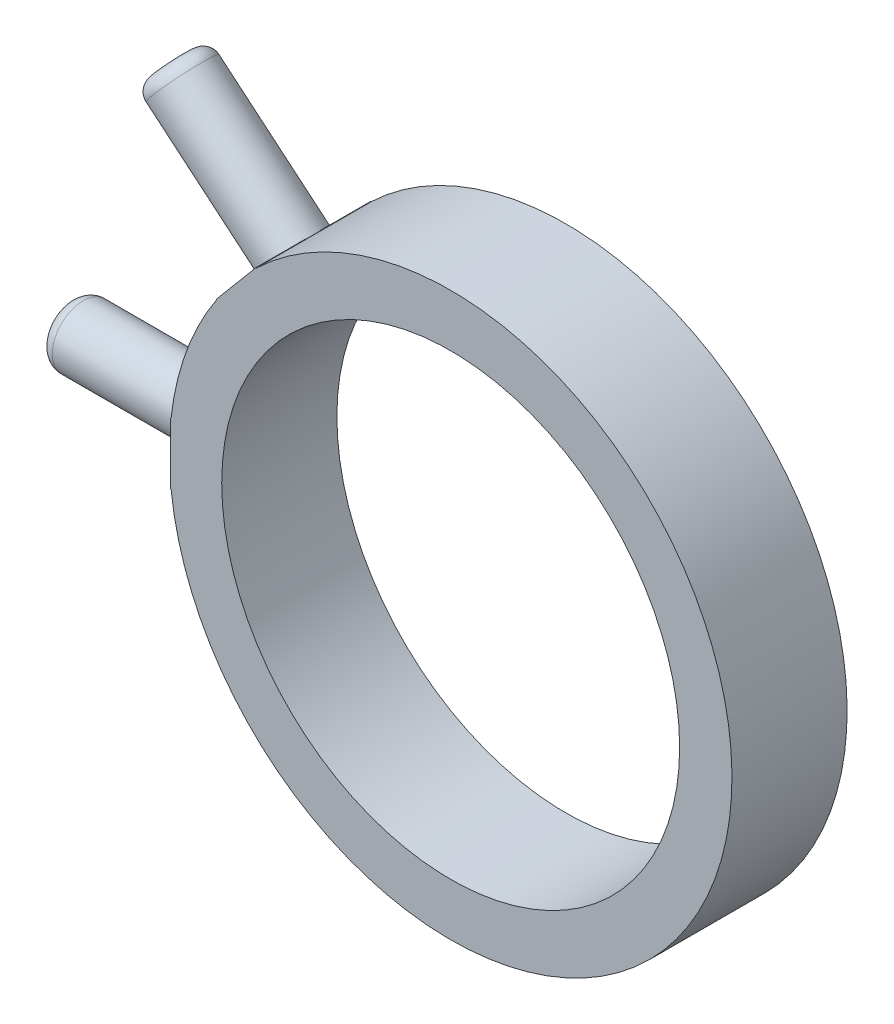
ISO-10303-21;
HEADER;
FILE_DESCRIPTION(('STEP AP214'),'2;1');
FILE_NAME('part.step','',(''),(''),'','','');
FILE_SCHEMA(('AUTOMOTIVE_DESIGN { 1 0 10303 214 1 1 1 1 }'));
ENDSEC;
DATA;
#1=APPLICATION_CONTEXT('core data for automotive mechanical design processes');
#2=APPLICATION_PROTOCOL_DEFINITION('international standard','automotive_design',2000,#1);
#3=PRODUCT_CONTEXT('',#1,'mechanical');
#4=PRODUCT('Part','Part','',(#3));
#5=PRODUCT_RELATED_PRODUCT_CATEGORY('part','',(#4));
#6=PRODUCT_DEFINITION_FORMATION('','',#4);
#7=PRODUCT_DEFINITION_CONTEXT('part definition',#1,'design');
#8=PRODUCT_DEFINITION('design','',#6,#7);
#9=PRODUCT_DEFINITION_SHAPE('','',#8);
#10=(LENGTH_UNIT() NAMED_UNIT(*) SI_UNIT(.MILLI.,.METRE.));
#11=(NAMED_UNIT(*) PLANE_ANGLE_UNIT() SI_UNIT($,.RADIAN.));
#12=(NAMED_UNIT(*) SI_UNIT($,.STERADIAN.) SOLID_ANGLE_UNIT());
#13=UNCERTAINTY_MEASURE_WITH_UNIT(LENGTH_MEASURE(1.E-05),#10,'distance_accuracy_value','');
#14=(GEOMETRIC_REPRESENTATION_CONTEXT(3) GLOBAL_UNCERTAINTY_ASSIGNED_CONTEXT((#13)) GLOBAL_UNIT_ASSIGNED_CONTEXT((#10,
#11,#12)) REPRESENTATION_CONTEXT('',''));
#15=CARTESIAN_POINT('',(0.,0.,0.));
#16=DIRECTION('',(0.,0.,1.));
#17=DIRECTION('',(1.,0.,0.));
#18=AXIS2_PLACEMENT_3D('',#15,#16,#17);
#19=CARTESIAN_POINT('',(0.,0.,8.8));
#20=DIRECTION('',(0.,0.,1.));
#21=DIRECTION('',(1.,0.,0.));
#22=AXIS2_PLACEMENT_3D('',#19,#20,#21);
#23=PLANE('',#22);
#24=CARTESIAN_POINT('',(0.,0.,8.8));
#25=DIRECTION('',(0.,0.,1.));
#26=DIRECTION('',(1.,0.,0.));
#27=AXIS2_PLACEMENT_3D('',#24,#25,#26);
#28=CIRCLE('',#27,17.5);
#29=CARTESIAN_POINT('',(17.5,0.,8.8));
#30=VERTEX_POINT('',#29);
#31=EDGE_CURVE('E193',#30,#30,#28,.T.);
#32=ORIENTED_EDGE('',*,*,#31,.F.);
#33=EDGE_LOOP('',(#32));
#34=FACE_BOUND('',#33,.T.);
#35=DIRECTION('',(1.,0.,0.));
#36=VECTOR('',#35,1.);
#37=CARTESIAN_POINT('',(-21.5,2.35,8.8));
#38=LINE('',#37,#36);
#39=CARTESIAN_POINT('',(-21.4,2.35,8.8));
#40=VERTEX_POINT('',#39);
#41=CARTESIAN_POINT('',(-21.3711838698749,2.35,8.8));
#42=VERTEX_POINT('',#41);
#43=EDGE_CURVE('E213',#40,#42,#38,.T.);
#44=ORIENTED_EDGE('',*,*,#43,.F.);
#45=DIRECTION('',(0.,-1.,0.));
#46=VECTOR('',#45,1.);
#47=CARTESIAN_POINT('',(-21.4,0.,8.8));
#48=LINE('',#47,#46);
#49=CARTESIAN_POINT('',(-21.4,-2.35,8.8));
#50=VERTEX_POINT('',#49);
#51=EDGE_CURVE('E160',#40,#50,#48,.T.);
#52=ORIENTED_EDGE('',*,*,#51,.T.);
#53=DIRECTION('',(1.,0.,0.));
#54=VECTOR('',#53,1.);
#55=CARTESIAN_POINT('',(-21.5,-2.35,8.8));
#56=LINE('',#55,#54);
#57=CARTESIAN_POINT('',(-21.3711838698749,-2.35,8.8));
#58=VERTEX_POINT('',#57);
#59=EDGE_CURVE('E200',#50,#58,#56,.T.);
#60=ORIENTED_EDGE('',*,*,#59,.T.);
#61=CARTESIAN_POINT('',(0.,0.,8.8));
#62=DIRECTION('',(0.,0.,1.));
#63=DIRECTION('',(1.,0.,0.));
#64=AXIS2_PLACEMENT_3D('',#61,#62,#63);
#65=CIRCLE('',#64,21.5);
#66=CARTESIAN_POINT('',(-14.8607257636283,15.537336637218,8.8));
#67=VERTEX_POINT('',#66);
#68=EDGE_CURVE('E202',#58,#67,#65,.T.);
#69=ORIENTED_EDGE('',*,*,#68,.T.);
#70=DIRECTION('',(0.766044443118975,-0.642787609686543,0.));
#71=VECTOR('',#70,1.);
#72=CARTESIAN_POINT('',(-24.151937961723,23.3335893658292,8.8));
#73=LINE('',#72,#71);
#74=CARTESIAN_POINT('',(-14.8828001999834,15.555859288622,8.8));
#75=VERTEX_POINT('',#74);
#76=EDGE_CURVE('E206',#75,#67,#73,.T.);
#77=ORIENTED_EDGE('',*,*,#76,.F.);
#78=DIRECTION('',(-0.642787609686543,-0.766044443118975,0.));
#79=VECTOR('',#78,1.);
#80=CARTESIAN_POINT('',(-16.3933510827467,13.7556548472926,8.8));
#81=LINE('',#80,#79);
#82=CARTESIAN_POINT('',(-17.9039019655102,11.9554504059628,8.8));
#83=VERTEX_POINT('',#82);
#84=EDGE_CURVE('E186',#75,#83,#81,.T.);
#85=ORIENTED_EDGE('',*,*,#84,.T.);
#86=DIRECTION('',(0.766044443118975,-0.642787609686543,0.));
#87=VECTOR('',#86,1.);
#88=CARTESIAN_POINT('',(-27.1730397272498,19.73318048317,8.8));
#89=LINE('',#88,#87);
#90=CARTESIAN_POINT('',(-17.881827529155,11.9369277545587,8.8));
#91=VERTEX_POINT('',#90);
#92=EDGE_CURVE('E208',#83,#91,#89,.T.);
#93=ORIENTED_EDGE('',*,*,#92,.T.);
#94=CARTESIAN_POINT('',(0.,0.,8.8));
#95=DIRECTION('',(0.,0.,1.));
#96=DIRECTION('',(1.,0.,0.));
#97=AXIS2_PLACEMENT_3D('',#94,#95,#96);
#98=CIRCLE('',#97,21.5);
#99=EDGE_CURVE('E210',#91,#42,#98,.T.);
#100=ORIENTED_EDGE('',*,*,#99,.T.);
#101=EDGE_LOOP('',(#44,#52,#60,#69,#77,#85,#93,#100));
#102=FACE_BOUND('',#101,.T.);
#103=ADVANCED_FACE('F78',(#34,#102),#23,.T.);
#104=CARTESIAN_POINT('',(0.,0.,0.));
#105=DIRECTION('',(0.,0.,1.));
#106=DIRECTION('',(1.,0.,0.));
#107=AXIS2_PLACEMENT_3D('',#104,#105,#106);
#108=PLANE('',#107);
#109=CARTESIAN_POINT('',(0.,0.,0.));
#110=DIRECTION('',(0.,0.,1.));
#111=DIRECTION('',(1.,0.,0.));
#112=AXIS2_PLACEMENT_3D('',#109,#110,#111);
#113=CIRCLE('',#112,17.5);
#114=CARTESIAN_POINT('',(17.5,0.,0.));
#115=VERTEX_POINT('',#114);
#116=EDGE_CURVE('E197',#115,#115,#113,.T.);
#117=ORIENTED_EDGE('',*,*,#116,.T.);
#118=EDGE_LOOP('',(#117));
#119=FACE_BOUND('',#118,.T.);
#120=DIRECTION('',(0.,-1.,0.));
#121=VECTOR('',#120,1.);
#122=CARTESIAN_POINT('',(-21.4,0.,0.));
#123=LINE('',#122,#121);
#124=CARTESIAN_POINT('',(-21.4,2.35,0.));
#125=VERTEX_POINT('',#124);
#126=CARTESIAN_POINT('',(-21.4,-2.35,0.));
#127=VERTEX_POINT('',#126);
#128=EDGE_CURVE('E174',#125,#127,#123,.T.);
#129=ORIENTED_EDGE('',*,*,#128,.F.);
#130=DIRECTION('',(1.,0.,0.));
#131=VECTOR('',#130,1.);
#132=CARTESIAN_POINT('',(-33.5,2.35,0.));
#133=LINE('',#132,#131);
#134=CARTESIAN_POINT('',(-21.3711838698749,2.35,0.));
#135=VERTEX_POINT('',#134);
#136=EDGE_CURVE('E178',#125,#135,#133,.T.);
#137=ORIENTED_EDGE('',*,*,#136,.T.);
#138=CARTESIAN_POINT('',(0.,0.,0.));
#139=DIRECTION('',(0.,0.,1.));
#140=DIRECTION('',(1.,0.,0.));
#141=AXIS2_PLACEMENT_3D('',#138,#139,#140);
#142=CIRCLE('',#141,21.5);
#143=CARTESIAN_POINT('',(-17.881827529155,11.9369277545587,0.));
#144=VERTEX_POINT('',#143);
#145=EDGE_CURVE('E222',#144,#135,#142,.T.);
#146=ORIENTED_EDGE('',*,*,#145,.F.);
#147=DIRECTION('',(0.766044443118975,-0.642787609686543,0.));
#148=VECTOR('',#147,1.);
#149=CARTESIAN_POINT('',(-27.1730397272498,19.73318048317,0.));
#150=LINE('',#149,#148);
#151=CARTESIAN_POINT('',(-17.9039019655102,11.9554504059628,0.));
#152=VERTEX_POINT('',#151);
#153=EDGE_CURVE('E220',#152,#144,#150,.T.);
#154=ORIENTED_EDGE('',*,*,#153,.F.);
#155=DIRECTION('',(-0.642787609686543,-0.766044443118975,0.));
#156=VECTOR('',#155,1.);
#157=CARTESIAN_POINT('',(-16.3933510827467,13.7556548472926,0.));
#158=LINE('',#157,#156);
#159=CARTESIAN_POINT('',(-14.8828001999834,15.555859288622,0.));
#160=VERTEX_POINT('',#159);
#161=EDGE_CURVE('E184',#160,#152,#158,.T.);
#162=ORIENTED_EDGE('',*,*,#161,.F.);
#163=DIRECTION('',(0.766044443118975,-0.642787609686543,0.));
#164=VECTOR('',#163,1.);
#165=CARTESIAN_POINT('',(-24.151937961723,23.3335893658292,0.));
#166=LINE('',#165,#164);
#167=CARTESIAN_POINT('',(-14.8607257636283,15.537336637218,0.));
#168=VERTEX_POINT('',#167);
#169=EDGE_CURVE('E218',#160,#168,#166,.T.);
#170=ORIENTED_EDGE('',*,*,#169,.T.);
#171=CARTESIAN_POINT('',(0.,0.,0.));
#172=DIRECTION('',(0.,0.,1.));
#173=DIRECTION('',(1.,0.,0.));
#174=AXIS2_PLACEMENT_3D('',#171,#172,#173);
#175=CIRCLE('',#174,21.5);
#176=CARTESIAN_POINT('',(-21.3711838698749,-2.35,0.));
#177=VERTEX_POINT('',#176);
#178=EDGE_CURVE('E196',#177,#168,#175,.T.);
#179=ORIENTED_EDGE('',*,*,#178,.F.);
#180=DIRECTION('',(1.,0.,0.));
#181=VECTOR('',#180,1.);
#182=CARTESIAN_POINT('',(-33.5,-2.35,0.));
#183=LINE('',#182,#181);
#184=EDGE_CURVE('E203',#127,#177,#183,.T.);
#185=ORIENTED_EDGE('',*,*,#184,.F.);
#186=EDGE_LOOP('',(#129,#137,#146,#154,#162,#170,#179,#185));
#187=FACE_BOUND('',#186,.T.);
#188=ADVANCED_FACE('F261',(#119,#187),#108,.F.);
#189=CARTESIAN_POINT('',(-33.5,2.35,8.8));
#190=DIRECTION('',(0.,1.,0.));
#191=DIRECTION('',(0.,0.,1.));
#192=AXIS2_PLACEMENT_3D('',#189,#190,#191);
#193=PLANE('',#192);
#194=ORIENTED_EDGE('',*,*,#136,.F.);
#195=DIRECTION('',(0.,0.,1.));
#196=VECTOR('',#195,1.);
#197=CARTESIAN_POINT('',(-21.4,2.35,8.8));
#198=LINE('',#197,#196);
#199=CARTESIAN_POINT('',(-21.4,2.35,4.4));
#200=VERTEX_POINT('',#199);
#201=EDGE_CURVE('E164',#125,#200,#198,.T.);
#202=ORIENTED_EDGE('',*,*,#201,.T.);
#203=EDGE_CURVE('E155',#200,#40,#198,.T.);
#204=ORIENTED_EDGE('',*,*,#203,.T.);
#205=ORIENTED_EDGE('',*,*,#43,.T.);
#206=DIRECTION('',(0.,0.,-1.));
#207=VECTOR('',#206,1.);
#208=CARTESIAN_POINT('',(-21.3711838698749,2.35,8.8));
#209=LINE('',#208,#207);
#210=EDGE_CURVE('E215',#42,#135,#209,.T.);
#211=ORIENTED_EDGE('',*,*,#210,.T.);
#212=EDGE_LOOP('',(#194,#202,#204,#205,#211));
#213=FACE_BOUND('',#212,.T.);
#214=ADVANCED_FACE('F176',(#213),#193,.T.);
#215=CARTESIAN_POINT('',(-33.5,-2.35,8.8));
#216=DIRECTION('',(0.,1.,0.));
#217=DIRECTION('',(0.,0.,1.));
#218=AXIS2_PLACEMENT_3D('',#215,#216,#217);
#219=PLANE('',#218);
#220=DIRECTION('',(0.,0.,1.));
#221=VECTOR('',#220,1.);
#222=CARTESIAN_POINT('',(-21.4,-2.35,8.8));
#223=LINE('',#222,#221);
#224=CARTESIAN_POINT('',(-21.4,-2.35,4.4));
#225=VERTEX_POINT('',#224);
#226=EDGE_CURVE('E172',#127,#225,#223,.T.);
#227=ORIENTED_EDGE('',*,*,#226,.F.);
#228=ORIENTED_EDGE('',*,*,#184,.T.);
#229=DIRECTION('',(0.,0.,-1.));
#230=VECTOR('',#229,1.);
#231=CARTESIAN_POINT('',(-21.3711838698749,-2.35,8.8));
#232=LINE('',#231,#230);
#233=EDGE_CURVE('E234',#58,#177,#232,.T.);
#234=ORIENTED_EDGE('',*,*,#233,.F.);
#235=ORIENTED_EDGE('',*,*,#59,.F.);
#236=EDGE_CURVE('E240',#225,#50,#223,.T.);
#237=ORIENTED_EDGE('',*,*,#236,.F.);
#238=EDGE_LOOP('',(#227,#228,#234,#235,#237));
#239=FACE_BOUND('',#238,.T.);
#240=ADVANCED_FACE('F275',(#239),#219,.F.);
#241=CARTESIAN_POINT('',(-24.151937961723,23.3335893658292,8.8));
#242=DIRECTION('',(0.642787609686543,0.766044443118975,0.));
#243=DIRECTION('',(-0.766044443118975,0.642787609686543,0.));
#244=AXIS2_PLACEMENT_3D('',#241,#242,#243);
#245=PLANE('',#244);
#246=ORIENTED_EDGE('',*,*,#169,.F.);
#247=DIRECTION('',(0.,0.,1.));
#248=VECTOR('',#247,1.);
#249=CARTESIAN_POINT('',(-14.8828001999834,15.555859288622,8.8));
#250=LINE('',#249,#248);
#251=CARTESIAN_POINT('',(-14.8828001999833,15.5558592886221,4.4));
#252=VERTEX_POINT('',#251);
#253=EDGE_CURVE('E192',#160,#252,#250,.T.);
#254=ORIENTED_EDGE('',*,*,#253,.T.);
#255=EDGE_CURVE('E189',#252,#75,#250,.T.);
#256=ORIENTED_EDGE('',*,*,#255,.T.);
#257=ORIENTED_EDGE('',*,*,#76,.T.);
#258=DIRECTION('',(0.,0.,-1.));
#259=VECTOR('',#258,1.);
#260=CARTESIAN_POINT('',(-14.8607257636283,15.537336637218,8.8));
#261=LINE('',#260,#259);
#262=EDGE_CURVE('E231',#67,#168,#261,.T.);
#263=ORIENTED_EDGE('',*,*,#262,.T.);
#264=EDGE_LOOP('',(#246,#254,#256,#257,#263));
#265=FACE_BOUND('',#264,.T.);
#266=ADVANCED_FACE('F278',(#265),#245,.T.);
#267=CARTESIAN_POINT('',(-27.1730397272498,19.73318048317,8.8));
#268=DIRECTION('',(0.642787609686543,0.766044443118975,0.));
#269=DIRECTION('',(-0.766044443118975,0.642787609686543,0.));
#270=AXIS2_PLACEMENT_3D('',#267,#268,#269);
#271=PLANE('',#270);
#272=DIRECTION('',(0.,0.,1.));
#273=VECTOR('',#272,1.);
#274=CARTESIAN_POINT('',(-17.9039019655102,11.9554504059628,8.8));
#275=LINE('',#274,#273);
#276=CARTESIAN_POINT('',(-17.9039019655102,11.9554504059628,4.4));
#277=VERTEX_POINT('',#276);
#278=EDGE_CURVE('E239',#152,#277,#275,.T.);
#279=ORIENTED_EDGE('',*,*,#278,.F.);
#280=ORIENTED_EDGE('',*,*,#153,.T.);
#281=DIRECTION('',(0.,0.,-1.));
#282=VECTOR('',#281,1.);
#283=CARTESIAN_POINT('',(-17.881827529155,11.9369277545587,8.8));
#284=LINE('',#283,#282);
#285=EDGE_CURVE('E228',#91,#144,#284,.T.);
#286=ORIENTED_EDGE('',*,*,#285,.F.);
#287=ORIENTED_EDGE('',*,*,#92,.F.);
#288=EDGE_CURVE('E237',#277,#83,#275,.T.);
#289=ORIENTED_EDGE('',*,*,#288,.F.);
#290=EDGE_LOOP('',(#279,#280,#286,#287,#289));
#291=FACE_BOUND('',#290,.T.);
#292=ADVANCED_FACE('F289',(#291),#271,.F.);
#293=CARTESIAN_POINT('',(0.,0.,8.8));
#294=DIRECTION('',(0.,0.,-1.));
#295=DIRECTION('',(-1.,0.,0.));
#296=AXIS2_PLACEMENT_3D('',#293,#294,#295);
#297=CYLINDRICAL_SURFACE('',#296,21.5);
#298=ORIENTED_EDGE('',*,*,#178,.T.);
#299=ORIENTED_EDGE('',*,*,#262,.F.);
#300=ORIENTED_EDGE('',*,*,#68,.F.);
#301=ORIENTED_EDGE('',*,*,#233,.T.);
#302=EDGE_LOOP('',(#298,#299,#300,#301));
#303=FACE_BOUND('',#302,.T.);
#304=ADVANCED_FACE('F287',(#303),#297,.T.);
#305=CARTESIAN_POINT('',(0.,0.,8.8));
#306=DIRECTION('',(0.,0.,-1.));
#307=DIRECTION('',(-1.,0.,0.));
#308=AXIS2_PLACEMENT_3D('',#305,#306,#307);
#309=CYLINDRICAL_SURFACE('',#308,21.5);
#310=ORIENTED_EDGE('',*,*,#145,.T.);
#311=ORIENTED_EDGE('',*,*,#210,.F.);
#312=ORIENTED_EDGE('',*,*,#99,.F.);
#313=ORIENTED_EDGE('',*,*,#285,.T.);
#314=EDGE_LOOP('',(#310,#311,#312,#313));
#315=FACE_BOUND('',#314,.T.);
#316=ADVANCED_FACE('F284',(#315),#309,.T.);
#317=CARTESIAN_POINT('',(0.,0.,8.8));
#318=DIRECTION('',(0.,0.,-1.));
#319=DIRECTION('',(-1.,0.,0.));
#320=AXIS2_PLACEMENT_3D('',#317,#318,#319);
#321=CYLINDRICAL_SURFACE('',#320,17.5);
#322=ORIENTED_EDGE('',*,*,#31,.T.);
#323=EDGE_LOOP('',(#322));
#324=FACE_BOUND('',#323,.T.);
#325=ORIENTED_EDGE('',*,*,#116,.F.);
#326=EDGE_LOOP('',(#325));
#327=FACE_BOUND('',#326,.T.);
#328=ADVANCED_FACE('F272',(#324,#327),#321,.F.);
#329=CARTESIAN_POINT('',(-16.3933510827467,13.7556548472926,4.4));
#330=DIRECTION('',(-0.766044443118975,0.642787609686543,0.));
#331=DIRECTION('',(-0.642787609686543,-0.766044443118975,0.));
#332=AXIS2_PLACEMENT_3D('',#329,#330,#331);
#333=PLANE('',#332);
#334=ORIENTED_EDGE('',*,*,#161,.T.);
#335=ORIENTED_EDGE('',*,*,#278,.T.);
#336=CARTESIAN_POINT('',(-16.3933510827467,13.7556548472926,4.4));
#337=DIRECTION('',(-0.766044443118975,0.642787609686543,0.));
#338=DIRECTION('',(-0.642787609686543,-0.766044443118975,0.));
#339=AXIS2_PLACEMENT_3D('',#336,#337,#338);
#340=CIRCLE('',#339,2.35000000000018);
#341=EDGE_CURVE('E179',#252,#277,#340,.T.);
#342=ORIENTED_EDGE('',*,*,#341,.F.);
#343=ORIENTED_EDGE('',*,*,#253,.F.);
#344=EDGE_LOOP('',(#334,#335,#342,#343));
#345=FACE_BOUND('',#344,.T.);
#346=ADVANCED_FACE('F327',(#345),#333,.T.);
#347=CARTESIAN_POINT('',(-16.3933510827467,13.7556548472926,4.4));
#348=DIRECTION('',(-0.766044443118975,0.642787609686543,0.));
#349=DIRECTION('',(-0.642787609686543,-0.766044443118975,0.));
#350=AXIS2_PLACEMENT_3D('',#347,#348,#349);
#351=CYLINDRICAL_SURFACE('',#350,2.35000000000018);
#352=CARTESIAN_POINT('',(-24.8964444013673,20.8905973148132,4.4));
#353=DIRECTION('',(-0.766044443118975,0.642787609686543,0.));
#354=DIRECTION('',(-0.642787609686543,-0.766044443118975,0.));
#355=AXIS2_PLACEMENT_3D('',#352,#353,#354);
#356=CIRCLE('',#355,2.35000000000018);
#357=CARTESIAN_POINT('',(-26.4069952841308,19.0903928734835,4.4));
#358=VERTEX_POINT('',#357);
#359=EDGE_CURVE('E245',#358,#358,#356,.F.);
#360=ORIENTED_EDGE('',*,*,#359,.T.);
#361=EDGE_LOOP('',(#360));
#362=FACE_BOUND('',#361,.T.);
#363=EDGE_CURVE('E100',#277,#252,#340,.T.);
#364=ORIENTED_EDGE('',*,*,#363,.T.);
#365=ORIENTED_EDGE('',*,*,#341,.T.);
#366=EDGE_LOOP('',(#364,#365));
#367=FACE_BOUND('',#366,.T.);
#368=ADVANCED_FACE('F329',(#362,#367),#351,.T.);
#369=ORIENTED_EDGE('',*,*,#363,.F.);
#370=ORIENTED_EDGE('',*,*,#288,.T.);
#371=ORIENTED_EDGE('',*,*,#84,.F.);
#372=ORIENTED_EDGE('',*,*,#255,.F.);
#373=EDGE_LOOP('',(#369,#370,#371,#372));
#374=FACE_BOUND('',#373,.T.);
#375=ADVANCED_FACE('F296',(#374),#333,.T.);
#376=CARTESIAN_POINT('',(-27.1730397272498,19.73318048317,8.8));
#377=DIRECTION('',(-0.766044443118975,0.642787609686543,0.));
#378=DIRECTION('',(-0.642787609686543,-0.766044443118975,0.));
#379=AXIS2_PLACEMENT_3D('',#376,#377,#378);
#380=PLANE('',#379);
#381=CARTESIAN_POINT('',(-25.6624888444863,21.5333849244997,4.4));
#382=DIRECTION('',(-0.766044443118975,0.642787609686543,0.));
#383=DIRECTION('',(-0.642787609686543,-0.766044443118975,0.));
#384=AXIS2_PLACEMENT_3D('',#381,#382,#383);
#385=CIRCLE('',#384,1.35000000000018);
#386=CARTESIAN_POINT('',(-26.5302521175632,20.499224926289,4.4));
#387=VERTEX_POINT('',#386);
#388=EDGE_CURVE('E242',#387,#387,#385,.T.);
#389=ORIENTED_EDGE('',*,*,#388,.T.);
#390=EDGE_LOOP('',(#389));
#391=FACE_BOUND('',#390,.T.);
#392=ADVANCED_FACE('F293',(#391),#380,.T.);
#393=CARTESIAN_POINT('',(-21.4,0.,4.4));
#394=DIRECTION('',(-1.,0.,0.));
#395=DIRECTION('',(0.,0.,1.));
#396=AXIS2_PLACEMENT_3D('',#393,#394,#395);
#397=PLANE('',#396);
#398=ORIENTED_EDGE('',*,*,#128,.T.);
#399=ORIENTED_EDGE('',*,*,#226,.T.);
#400=CARTESIAN_POINT('',(-21.4,0.,4.4));
#401=DIRECTION('',(-1.,0.,0.));
#402=DIRECTION('',(0.,0.,1.));
#403=AXIS2_PLACEMENT_3D('',#400,#401,#402);
#404=CIRCLE('',#403,2.35);
#405=EDGE_CURVE('E92',#200,#225,#404,.T.);
#406=ORIENTED_EDGE('',*,*,#405,.F.);
#407=ORIENTED_EDGE('',*,*,#201,.F.);
#408=EDGE_LOOP('',(#398,#399,#406,#407));
#409=FACE_BOUND('',#408,.T.);
#410=ADVANCED_FACE('F169',(#409),#397,.T.);
#411=CARTESIAN_POINT('',(-21.4,0.,4.4));
#412=DIRECTION('',(-1.,0.,0.));
#413=DIRECTION('',(0.,0.,1.));
#414=AXIS2_PLACEMENT_3D('',#411,#412,#413);
#415=CYLINDRICAL_SURFACE('',#414,2.35);
#416=CARTESIAN_POINT('',(-32.5,0.,4.4));
#417=DIRECTION('',(1.,0.,0.));
#418=DIRECTION('',(0.,0.,-1.));
#419=AXIS2_PLACEMENT_3D('',#416,#417,#418);
#420=CIRCLE('',#419,2.35);
#421=CARTESIAN_POINT('',(-32.5,0.,2.05));
#422=VERTEX_POINT('',#421);
#423=EDGE_CURVE('E12',#422,#422,#420,.T.);
#424=ORIENTED_EDGE('',*,*,#423,.T.);
#425=EDGE_LOOP('',(#424));
#426=FACE_BOUND('',#425,.T.);
#427=EDGE_CURVE('E157',#225,#200,#404,.T.);
#428=ORIENTED_EDGE('',*,*,#427,.T.);
#429=ORIENTED_EDGE('',*,*,#405,.T.);
#430=EDGE_LOOP('',(#428,#429));
#431=FACE_BOUND('',#430,.T.);
#432=ADVANCED_FACE('F166',(#426,#431),#415,.T.);
#433=ORIENTED_EDGE('',*,*,#427,.F.);
#434=ORIENTED_EDGE('',*,*,#236,.T.);
#435=ORIENTED_EDGE('',*,*,#51,.F.);
#436=ORIENTED_EDGE('',*,*,#203,.F.);
#437=EDGE_LOOP('',(#433,#434,#435,#436));
#438=FACE_BOUND('',#437,.T.);
#439=ADVANCED_FACE('F156',(#438),#397,.T.);
#440=CARTESIAN_POINT('',(-33.5,2.35,8.8));
#441=DIRECTION('',(1.,0.,0.));
#442=DIRECTION('',(0.,0.,-1.));
#443=AXIS2_PLACEMENT_3D('',#440,#441,#442);
#444=PLANE('',#443);
#445=CARTESIAN_POINT('',(-33.5,0.,4.4));
#446=DIRECTION('',(1.,0.,0.));
#447=DIRECTION('',(0.,0.,-1.));
#448=AXIS2_PLACEMENT_3D('',#445,#446,#447);
#449=CIRCLE('',#448,1.35);
#450=CARTESIAN_POINT('',(-33.5,0.,3.05));
#451=VERTEX_POINT('',#450);
#452=EDGE_CURVE('E86',#451,#451,#449,.F.);
#453=ORIENTED_EDGE('',*,*,#452,.T.);
#454=EDGE_LOOP('',(#453));
#455=FACE_BOUND('',#454,.T.);
#456=ADVANCED_FACE('F250',(#455),#444,.F.);
#457=CARTESIAN_POINT('',(-24.8964444013673,20.8905973148132,4.4));
#458=DIRECTION('',(-0.766044443118975,0.642787609686543,0.));
#459=DIRECTION('',(-0.642787609686543,-0.766044443118975,0.));
#460=AXIS2_PLACEMENT_3D('',#457,#458,#459);
#461=TOROIDAL_SURFACE('',#460,1.35000000000018,1.);
#462=ORIENTED_EDGE('',*,*,#359,.F.);
#463=EDGE_LOOP('',(#462));
#464=FACE_BOUND('',#463,.T.);
#465=ORIENTED_EDGE('',*,*,#388,.F.);
#466=EDGE_LOOP('',(#465));
#467=FACE_BOUND('',#466,.T.);
#468=ADVANCED_FACE('F253',(#464,#467),#461,.T.);
#469=CARTESIAN_POINT('',(-32.5,0.,4.4));
#470=DIRECTION('',(1.,0.,0.));
#471=DIRECTION('',(0.,0.,-1.));
#472=AXIS2_PLACEMENT_3D('',#469,#470,#471);
#473=TOROIDAL_SURFACE('',#472,1.35,1.);
#474=ORIENTED_EDGE('',*,*,#423,.F.);
#475=EDGE_LOOP('',(#474));
#476=FACE_BOUND('',#475,.T.);
#477=ORIENTED_EDGE('',*,*,#452,.F.);
#478=EDGE_LOOP('',(#477));
#479=FACE_BOUND('',#478,.T.);
#480=ADVANCED_FACE('F80',(#476,#479),#473,.T.);
#481=CLOSED_SHELL('',(#103,#188,#214,#240,#266,#292,#304,#316,#328,#346,#368,#375,#392,#410,
#432,#439,#456,#468,#480));
#482=MANIFOLD_SOLID_BREP('B2',#481);
#483=ADVANCED_BREP_SHAPE_REPRESENTATION('',(#18,#482),#14);
#484=SHAPE_DEFINITION_REPRESENTATION(#9,#483);
ENDSEC;
END-ISO-10303-21;
